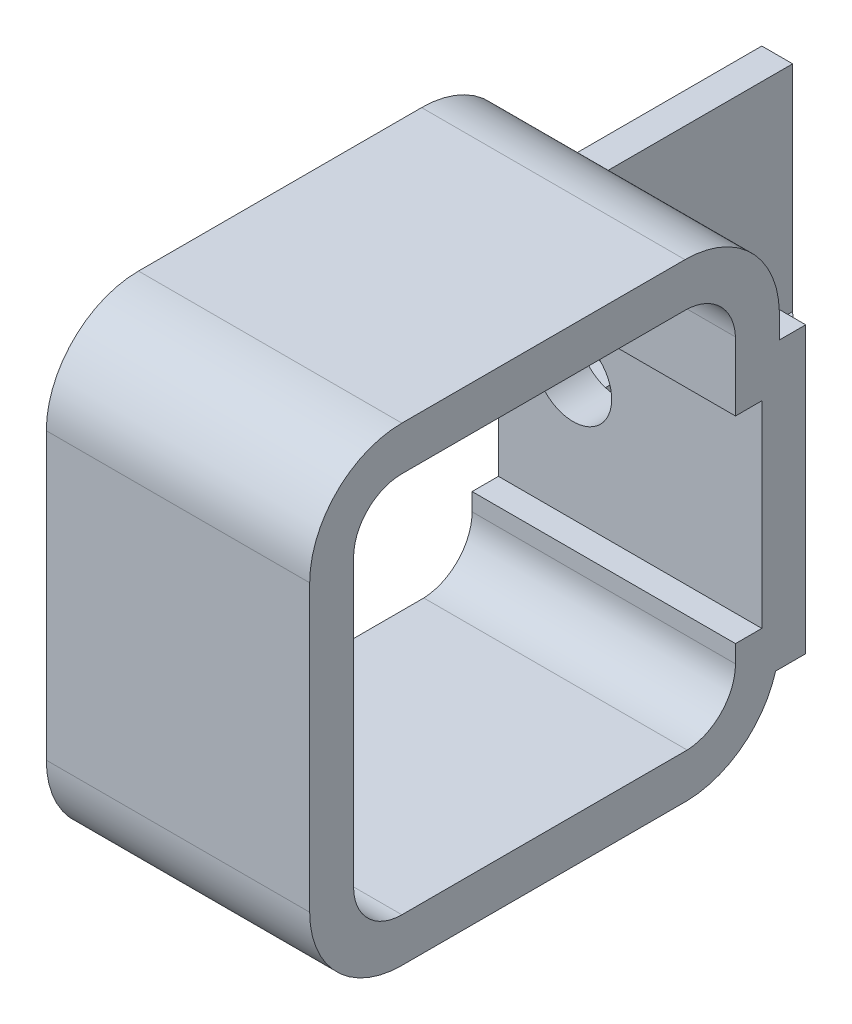
ISO-10303-21;
HEADER;
FILE_DESCRIPTION(('STEP AP214'),'2;1');
FILE_NAME('part.step','',(''),(''),'','','');
FILE_SCHEMA(('AUTOMOTIVE_DESIGN { 1 0 10303 214 1 1 1 1 }'));
ENDSEC;
DATA;
#1=APPLICATION_CONTEXT('core data for automotive mechanical design processes');
#2=APPLICATION_PROTOCOL_DEFINITION('international standard','automotive_design',2000,#1);
#3=PRODUCT_CONTEXT('',#1,'mechanical');
#4=PRODUCT('Part','Part','',(#3));
#5=PRODUCT_RELATED_PRODUCT_CATEGORY('part','',(#4));
#6=PRODUCT_DEFINITION_FORMATION('','',#4);
#7=PRODUCT_DEFINITION_CONTEXT('part definition',#1,'design');
#8=PRODUCT_DEFINITION('design','',#6,#7);
#9=PRODUCT_DEFINITION_SHAPE('','',#8);
#10=(LENGTH_UNIT() NAMED_UNIT(*) SI_UNIT(.MILLI.,.METRE.));
#11=(NAMED_UNIT(*) PLANE_ANGLE_UNIT() SI_UNIT($,.RADIAN.));
#12=(NAMED_UNIT(*) SI_UNIT($,.STERADIAN.) SOLID_ANGLE_UNIT());
#13=UNCERTAINTY_MEASURE_WITH_UNIT(LENGTH_MEASURE(1.E-05),#10,'distance_accuracy_value','');
#14=(GEOMETRIC_REPRESENTATION_CONTEXT(3) GLOBAL_UNCERTAINTY_ASSIGNED_CONTEXT((#13)) GLOBAL_UNIT_ASSIGNED_CONTEXT((#10,
#11,#12)) REPRESENTATION_CONTEXT('',''));
#15=CARTESIAN_POINT('',(0.,0.,0.));
#16=DIRECTION('',(0.,0.,1.));
#17=DIRECTION('',(1.,0.,0.));
#18=AXIS2_PLACEMENT_3D('',#15,#16,#17);
#19=CARTESIAN_POINT('',(0.,0.,0.));
#20=DIRECTION('',(1.,0.,0.));
#21=DIRECTION('',(0.,0.,-1.));
#22=AXIS2_PLACEMENT_3D('',#19,#20,#21);
#23=PLANE('',#22);
#24=DIRECTION('',(0.,-1.,0.));
#25=VECTOR('',#24,1.);
#26=CARTESIAN_POINT('',(0.,0.,13.0376172660877));
#27=LINE('',#26,#25);
#28=CARTESIAN_POINT('',(0.,-3.53074133145201,13.0376172660876));
#29=VERTEX_POINT('',#28);
#30=CARTESIAN_POINT('',(0.,-36.0307413314518,13.0376172660875));
#31=VERTEX_POINT('',#30);
#32=EDGE_CURVE('E413',#29,#31,#27,.T.);
#33=ORIENTED_EDGE('',*,*,#32,.T.);
#34=CARTESIAN_POINT('',(0.,-36.0307413314518,7.53761726608743));
#35=DIRECTION('',(1.,0.,0.));
#36=DIRECTION('',(0.,0.,-1.));
#37=AXIS2_PLACEMENT_3D('',#34,#35,#36);
#38=CIRCLE('',#37,5.5000000000001);
#39=CARTESIAN_POINT('',(0.,-41.5307413314519,7.53761726608741));
#40=VERTEX_POINT('',#39);
#41=EDGE_CURVE('E323',#40,#31,#38,.F.);
#42=ORIENTED_EDGE('',*,*,#41,.F.);
#43=DIRECTION('',(0.,0.,-1.));
#44=VECTOR('',#43,1.);
#45=CARTESIAN_POINT('',(0.,-41.5307413314519,0.));
#46=LINE('',#45,#44);
#47=CARTESIAN_POINT('',(0.,-41.5307413314519,-24.9623827339103));
#48=VERTEX_POINT('',#47);
#49=EDGE_CURVE('E443',#40,#48,#46,.T.);
#50=ORIENTED_EDGE('',*,*,#49,.T.);
#51=CARTESIAN_POINT('',(0.,-35.7807413314519,-24.7067009157306));
#52=DIRECTION('',(1.,0.,0.));
#53=DIRECTION('',(0.,0.,-1.));
#54=AXIS2_PLACEMENT_3D('',#51,#52,#53);
#55=CIRCLE('',#54,5.75568181818172);
#56=CARTESIAN_POINT('',(0.,-35.7807413314518,-30.4623827339124));
#57=VERTEX_POINT('',#56);
#58=EDGE_CURVE('E440',#57,#48,#55,.F.);
#59=ORIENTED_EDGE('',*,*,#58,.F.);
#60=DIRECTION('',(0.,-1.,0.));
#61=VECTOR('',#60,1.);
#62=CARTESIAN_POINT('',(0.,5.28438104627105E-13,-30.4623827339117));
#63=LINE('',#62,#61);
#64=CARTESIAN_POINT('',(0.,-33.7807413314519,-30.4623827339123));
#65=VERTEX_POINT('',#64);
#66=EDGE_CURVE('E437',#65,#57,#63,.T.);
#67=ORIENTED_EDGE('',*,*,#66,.F.);
#68=DIRECTION('',(0.,0.,1.));
#69=VECTOR('',#68,1.);
#70=CARTESIAN_POINT('',(0.,-33.7807413314519,0.));
#71=LINE('',#70,#69);
#72=CARTESIAN_POINT('',(0.,-33.7807413314519,-33.4623827339123));
#73=VERTEX_POINT('',#72);
#74=EDGE_CURVE('E434',#73,#65,#71,.T.);
#75=ORIENTED_EDGE('',*,*,#74,.F.);
#76=DIRECTION('',(0.,-1.,0.));
#77=VECTOR('',#76,1.);
#78=CARTESIAN_POINT('',(0.,0.,-33.4623827339123));
#79=LINE('',#78,#77);
#80=CARTESIAN_POINT('',(0.,-11.3307413314518,-33.4623827339123));
#81=VERTEX_POINT('',#80);
#82=EDGE_CURVE('E431',#81,#73,#79,.T.);
#83=ORIENTED_EDGE('',*,*,#82,.F.);
#84=DIRECTION('',(0.,0.,-1.));
#85=VECTOR('',#84,1.);
#86=CARTESIAN_POINT('',(0.,-11.3307413314518,0.));
#87=LINE('',#86,#85);
#88=CARTESIAN_POINT('',(0.,-11.3307413314518,-30.4623827339123));
#89=VERTEX_POINT('',#88);
#90=EDGE_CURVE('E428',#89,#81,#87,.T.);
#91=ORIENTED_EDGE('',*,*,#90,.F.);
#92=DIRECTION('',(0.,-1.,0.));
#93=VECTOR('',#92,1.);
#94=CARTESIAN_POINT('',(0.,3.11642984780029E-13,-30.4623827339122));
#95=LINE('',#94,#93);
#96=CARTESIAN_POINT('',(0.,-3.53074133145067,-30.4623827339122));
#97=VERTEX_POINT('',#96);
#98=EDGE_CURVE('E425',#97,#89,#95,.T.);
#99=ORIENTED_EDGE('',*,*,#98,.F.);
#100=CARTESIAN_POINT('',(0.,-3.78642314963352,-24.7123827339124));
#101=DIRECTION('',(1.,0.,0.));
#102=DIRECTION('',(0.,0.,-1.));
#103=AXIS2_PLACEMENT_3D('',#100,#101,#102);
#104=CIRCLE('',#103,5.75568181818172);
#105=CARTESIAN_POINT('',(0.,1.96925866854822,-24.7123827339124));
#106=VERTEX_POINT('',#105);
#107=EDGE_CURVE('E422',#106,#97,#104,.F.);
#108=ORIENTED_EDGE('',*,*,#107,.F.);
#109=DIRECTION('',(0.,0.,-1.));
#110=VECTOR('',#109,1.);
#111=CARTESIAN_POINT('',(0.,1.96925866854803,0.));
#112=LINE('',#111,#110);
#113=CARTESIAN_POINT('',(0.,1.96925866854797,7.53761726608761));
#114=VERTEX_POINT('',#113);
#115=EDGE_CURVE('E419',#114,#106,#112,.T.);
#116=ORIENTED_EDGE('',*,*,#115,.F.);
#117=CARTESIAN_POINT('',(0.,-3.53074133145199,7.53761726608768));
#118=DIRECTION('',(1.,0.,0.));
#119=DIRECTION('',(0.,0.,-1.));
#120=AXIS2_PLACEMENT_3D('',#117,#118,#119);
#121=CIRCLE('',#120,5.49999999999996);
#122=EDGE_CURVE('E416',#29,#114,#121,.F.);
#123=ORIENTED_EDGE('',*,*,#122,.F.);
#124=EDGE_LOOP('',(#33,#42,#50,#59,#67,#75,#83,#91,#99,#108,#116,#123));
#125=FACE_BOUND('',#124,.T.);
#126=CARTESIAN_POINT('',(0.,-3.78371752192795,-24.7123827339124));
#127=DIRECTION('',(1.,0.,0.));
#128=DIRECTION('',(0.,0.,-1.));
#129=AXIS2_PLACEMENT_3D('',#126,#127,#128);
#130=CIRCLE('',#129,10.752976190476);
#131=CARTESIAN_POINT('',(0.,6.96925866854797,-24.7123827339124));
#132=VERTEX_POINT('',#131);
#133=CARTESIAN_POINT('',(0.,-3.53074133145067,-35.4623827339122));
#134=VERTEX_POINT('',#133);
#135=EDGE_CURVE('E318',#132,#134,#130,.F.);
#136=ORIENTED_EDGE('',*,*,#135,.T.);
#137=DIRECTION('',(0.,-1.,-1.06561584952806E-13));
#138=VECTOR('',#137,1.);
#139=CARTESIAN_POINT('',(0.,3.77892771032867E-12,-35.4623827339119));
#140=LINE('',#139,#138);
#141=CARTESIAN_POINT('',(0.,-6.33074133145212,-35.4623827339125));
#142=VERTEX_POINT('',#141);
#143=EDGE_CURVE('E410',#134,#142,#140,.T.);
#144=ORIENTED_EDGE('',*,*,#143,.T.);
#145=DIRECTION('',(0.,0.,-1.));
#146=VECTOR('',#145,1.);
#147=CARTESIAN_POINT('',(0.,-6.33074133145212,0.));
#148=LINE('',#147,#146);
#149=CARTESIAN_POINT('',(0.,-6.33074133145209,-63.4623827339123));
#150=VERTEX_POINT('',#149);
#151=EDGE_CURVE('E408',#142,#150,#148,.T.);
#152=ORIENTED_EDGE('',*,*,#151,.T.);
#153=DIRECTION('',(0.,-1.,0.));
#154=VECTOR('',#153,1.);
#155=CARTESIAN_POINT('',(0.,-6.33074133145209,-63.4623827339123));
#156=LINE('',#155,#154);
#157=CARTESIAN_POINT('',(0.,-38.7807413314519,-63.4623827339123));
#158=VERTEX_POINT('',#157);
#159=EDGE_CURVE('E305',#150,#158,#156,.T.);
#160=ORIENTED_EDGE('',*,*,#159,.T.);
#161=DIRECTION('',(0.,0.,1.));
#162=VECTOR('',#161,1.);
#163=CARTESIAN_POINT('',(0.,-38.7807413314519,0.));
#164=LINE('',#163,#162);
#165=CARTESIAN_POINT('',(0.,-38.7807413314519,-35.035529086146));
#166=VERTEX_POINT('',#165);
#167=EDGE_CURVE('E405',#158,#166,#164,.T.);
#168=ORIENTED_EDGE('',*,*,#167,.T.);
#169=CARTESIAN_POINT('',(0.,-35.7807413314518,-24.7067009157306));
#170=DIRECTION('',(1.,0.,0.));
#171=DIRECTION('',(0.,0.,-1.));
#172=AXIS2_PLACEMENT_3D('',#169,#170,#171);
#173=CIRCLE('',#172,10.7556818181819);
#174=CARTESIAN_POINT('',(0.,-46.5307413314519,-25.0562597433475));
#175=VERTEX_POINT('',#174);
#176=EDGE_CURVE('E402',#166,#175,#173,.F.);
#177=ORIENTED_EDGE('',*,*,#176,.T.);
#178=DIRECTION('',(0.,0.,-1.));
#179=VECTOR('',#178,1.);
#180=CARTESIAN_POINT('',(0.,-46.5307413314519,0.));
#181=LINE('',#180,#179);
#182=CARTESIAN_POINT('',(0.,-46.5307413314519,7.53761726608754));
#183=VERTEX_POINT('',#182);
#184=EDGE_CURVE('E399',#183,#175,#181,.T.);
#185=ORIENTED_EDGE('',*,*,#184,.F.);
#186=CARTESIAN_POINT('',(0.,-36.0307413314518,7.53761726608754));
#187=DIRECTION('',(1.,0.,0.));
#188=DIRECTION('',(0.,0.,-1.));
#189=AXIS2_PLACEMENT_3D('',#186,#187,#188);
#190=CIRCLE('',#189,10.5000000000001);
#191=CARTESIAN_POINT('',(0.,-36.0307413314518,18.0376172660876));
#192=VERTEX_POINT('',#191);
#193=EDGE_CURVE('E396',#183,#192,#190,.F.);
#194=ORIENTED_EDGE('',*,*,#193,.T.);
#195=DIRECTION('',(0.,-1.,0.));
#196=VECTOR('',#195,1.);
#197=CARTESIAN_POINT('',(0.,0.,18.0376172660876));
#198=LINE('',#197,#196);
#199=CARTESIAN_POINT('',(0.,-3.53074133145199,18.0376172660876));
#200=VERTEX_POINT('',#199);
#201=EDGE_CURVE('E393',#200,#192,#198,.T.);
#202=ORIENTED_EDGE('',*,*,#201,.F.);
#203=CARTESIAN_POINT('',(0.,-3.53074133145223,7.53761726608768));
#204=DIRECTION('',(1.,0.,0.));
#205=DIRECTION('',(0.,0.,-1.));
#206=AXIS2_PLACEMENT_3D('',#203,#204,#205);
#207=CIRCLE('',#206,10.5000000000001);
#208=CARTESIAN_POINT('',(0.,6.96925866854797,7.53761726608768));
#209=VERTEX_POINT('',#208);
#210=EDGE_CURVE('E390',#200,#209,#207,.F.);
#211=ORIENTED_EDGE('',*,*,#210,.T.);
#212=DIRECTION('',(0.,0.,-1.));
#213=VECTOR('',#212,1.);
#214=CARTESIAN_POINT('',(0.,6.96925866854797,0.));
#215=LINE('',#214,#213);
#216=EDGE_CURVE('E387',#209,#132,#215,.T.);
#217=ORIENTED_EDGE('',*,*,#216,.T.);
#218=EDGE_LOOP('',(#136,#144,#152,#160,#168,#177,#185,#194,#202,#211,#217));
#219=FACE_BOUND('',#218,.T.);
#220=CARTESIAN_POINT('',(0.,-22.6397290251602,-53.4623827339123));
#221=DIRECTION('',(1.,0.,0.));
#222=DIRECTION('',(0.,0.,-1.));
#223=AXIS2_PLACEMENT_3D('',#220,#221,#222);
#224=CIRCLE('',#223,3.);
#225=CARTESIAN_POINT('',(0.,-22.6397290251602,-56.4623827339123));
#226=VERTEX_POINT('',#225);
#227=EDGE_CURVE('E292',#226,#226,#224,.T.);
#228=ORIENTED_EDGE('',*,*,#227,.T.);
#229=EDGE_LOOP('',(#228));
#230=FACE_BOUND('',#229,.T.);
#231=DIRECTION('',(0.,1.,0.));
#232=VECTOR('',#231,1.);
#233=CARTESIAN_POINT('',(0.,0.,-44.4623827339123));
#234=LINE('',#233,#232);
#235=CARTESIAN_POINT('',(0.,-27.613548677598,-44.4623827339123));
#236=VERTEX_POINT('',#235);
#237=CARTESIAN_POINT('',(0.,-12.613548677598,-44.4623827339123));
#238=VERTEX_POINT('',#237);
#239=EDGE_CURVE('E249',#236,#238,#234,.T.);
#240=ORIENTED_EDGE('',*,*,#239,.T.);
#241=DIRECTION('',(0.,0.,1.));
#242=VECTOR('',#241,1.);
#243=CARTESIAN_POINT('',(0.,-12.613548677598,0.));
#244=LINE('',#243,#242);
#245=CARTESIAN_POINT('',(0.,-12.613548677598,-38.4623827339123));
#246=VERTEX_POINT('',#245);
#247=EDGE_CURVE('E271',#238,#246,#244,.T.);
#248=ORIENTED_EDGE('',*,*,#247,.T.);
#249=DIRECTION('',(0.,1.,0.));
#250=VECTOR('',#249,1.);
#251=CARTESIAN_POINT('',(0.,0.,-38.4623827339123));
#252=LINE('',#251,#250);
#253=CARTESIAN_POINT('',(0.,-27.613548677598,-38.4623827339123));
#254=VERTEX_POINT('',#253);
#255=EDGE_CURVE('E558',#254,#246,#252,.T.);
#256=ORIENTED_EDGE('',*,*,#255,.F.);
#257=DIRECTION('',(0.,0.,-1.));
#258=VECTOR('',#257,1.);
#259=CARTESIAN_POINT('',(0.,-27.613548677598,0.));
#260=LINE('',#259,#258);
#261=EDGE_CURVE('E275',#254,#236,#260,.T.);
#262=ORIENTED_EDGE('',*,*,#261,.T.);
#263=EDGE_LOOP('',(#240,#248,#256,#262));
#264=FACE_BOUND('',#263,.T.);
#265=ADVANCED_FACE('F47',(#125,#219,#230,#264),#23,.F.);
#266=CARTESIAN_POINT('',(3.51144321135217,-6.33074133145209,-63.4623827339123));
#267=DIRECTION('',(-1.,0.,0.));
#268=DIRECTION('',(0.,0.,1.));
#269=AXIS2_PLACEMENT_3D('',#266,#267,#268);
#270=PLANE('',#269);
#271=CARTESIAN_POINT('',(3.51144321135217,-22.6397290251602,-53.4623827339123));
#272=DIRECTION('',(1.,0.,0.));
#273=DIRECTION('',(0.,0.,-1.));
#274=AXIS2_PLACEMENT_3D('',#271,#272,#273);
#275=CIRCLE('',#274,3.);
#276=CARTESIAN_POINT('',(3.51144321135217,-22.6397290251602,-56.4623827339123));
#277=VERTEX_POINT('',#276);
#278=EDGE_CURVE('E289',#277,#277,#275,.T.);
#279=ORIENTED_EDGE('',*,*,#278,.F.);
#280=EDGE_LOOP('',(#279));
#281=FACE_BOUND('',#280,.T.);
#282=DIRECTION('',(0.,0.,-1.));
#283=VECTOR('',#282,1.);
#284=CARTESIAN_POINT('',(3.51144321135217,-12.613548677598,0.));
#285=LINE('',#284,#283);
#286=CARTESIAN_POINT('',(3.51144321135217,-12.613548677598,-38.4623827339123));
#287=VERTEX_POINT('',#286);
#288=CARTESIAN_POINT('',(3.51144321135217,-12.613548677598,-44.4623827339123));
#289=VERTEX_POINT('',#288);
#290=EDGE_CURVE('E252',#287,#289,#285,.T.);
#291=ORIENTED_EDGE('',*,*,#290,.T.);
#292=DIRECTION('',(0.,-1.,0.));
#293=VECTOR('',#292,1.);
#294=CARTESIAN_POINT('',(3.51144321135217,0.,-44.4623827339123));
#295=LINE('',#294,#293);
#296=CARTESIAN_POINT('',(3.51144321135217,-27.613548677598,-44.4623827339123));
#297=VERTEX_POINT('',#296);
#298=EDGE_CURVE('E246',#289,#297,#295,.T.);
#299=ORIENTED_EDGE('',*,*,#298,.T.);
#300=DIRECTION('',(0.,0.,1.));
#301=VECTOR('',#300,1.);
#302=CARTESIAN_POINT('',(3.51144321135217,-27.613548677598,0.));
#303=LINE('',#302,#301);
#304=CARTESIAN_POINT('',(3.51144321135217,-27.613548677598,-38.4623827339123));
#305=VERTEX_POINT('',#304);
#306=EDGE_CURVE('E254',#297,#305,#303,.T.);
#307=ORIENTED_EDGE('',*,*,#306,.T.);
#308=DIRECTION('',(0.,-1.,0.));
#309=VECTOR('',#308,1.);
#310=CARTESIAN_POINT('',(3.51144321135217,-6.33074133145212,-38.4623827339123));
#311=LINE('',#310,#309);
#312=CARTESIAN_POINT('',(3.51144321135217,-30.7807413314519,-38.4623827339123));
#313=VERTEX_POINT('',#312);
#314=EDGE_CURVE('E295',#305,#313,#311,.T.);
#315=ORIENTED_EDGE('',*,*,#314,.T.);
#316=DIRECTION('',(0.,0.,1.));
#317=VECTOR('',#316,1.);
#318=CARTESIAN_POINT('',(3.51144321135217,-30.7807413314519,-91.1326490995515));
#319=LINE('',#318,#317);
#320=CARTESIAN_POINT('',(3.51144321135217,-30.7807413314519,-63.4623827339123));
#321=VERTEX_POINT('',#320);
#322=EDGE_CURVE('E286',#321,#313,#319,.T.);
#323=ORIENTED_EDGE('',*,*,#322,.F.);
#324=DIRECTION('',(0.,-1.,0.));
#325=VECTOR('',#324,1.);
#326=CARTESIAN_POINT('',(3.51144321135217,-6.33074133145209,-63.4623827339123));
#327=LINE('',#326,#325);
#328=CARTESIAN_POINT('',(3.51144321135217,-6.33074133145209,-63.4623827339123));
#329=VERTEX_POINT('',#328);
#330=EDGE_CURVE('E299',#329,#321,#327,.T.);
#331=ORIENTED_EDGE('',*,*,#330,.F.);
#332=DIRECTION('',(0.,0.,1.));
#333=VECTOR('',#332,1.);
#334=CARTESIAN_POINT('',(3.51144321135217,-6.33074133145209,-63.4623827339123));
#335=LINE('',#334,#333);
#336=CARTESIAN_POINT('',(3.51144321135217,-6.33074133145212,-38.4623827339123));
#337=VERTEX_POINT('',#336);
#338=EDGE_CURVE('E308',#329,#337,#335,.T.);
#339=ORIENTED_EDGE('',*,*,#338,.T.);
#340=EDGE_CURVE('E300',#337,#287,#311,.T.);
#341=ORIENTED_EDGE('',*,*,#340,.T.);
#342=EDGE_LOOP('',(#291,#299,#307,#315,#323,#331,#339,#341));
#343=FACE_BOUND('',#342,.T.);
#344=ADVANCED_FACE('F259',(#281,#343),#270,.F.);
#345=CARTESIAN_POINT('',(30.,0.,13.0376172660877));
#346=DIRECTION('',(0.,0.,-1.));
#347=DIRECTION('',(0.,1.,0.));
#348=AXIS2_PLACEMENT_3D('',#345,#346,#347);
#349=PLANE('',#348);
#350=ORIENTED_EDGE('',*,*,#32,.F.);
#351=DIRECTION('',(-1.,0.,0.));
#352=VECTOR('',#351,1.);
#353=CARTESIAN_POINT('',(30.,-3.53074133145201,13.0376172660876));
#354=LINE('',#353,#352);
#355=CARTESIAN_POINT('',(30.,-3.53074133145201,13.0376172660876));
#356=VERTEX_POINT('',#355);
#357=EDGE_CURVE('E11',#356,#29,#354,.T.);
#358=ORIENTED_EDGE('',*,*,#357,.F.);
#359=DIRECTION('',(0.,-1.,0.));
#360=VECTOR('',#359,1.);
#361=CARTESIAN_POINT('',(30.,0.,13.0376172660877));
#362=LINE('',#361,#360);
#363=CARTESIAN_POINT('',(30.,-36.0307413314518,13.0376172660875));
#364=VERTEX_POINT('',#363);
#365=EDGE_CURVE('E350',#356,#364,#362,.T.);
#366=ORIENTED_EDGE('',*,*,#365,.T.);
#367=DIRECTION('',(-1.,0.,0.));
#368=VECTOR('',#367,1.);
#369=CARTESIAN_POINT('',(30.,-36.0307413314518,13.0376172660875));
#370=LINE('',#369,#368);
#371=EDGE_CURVE('E448',#364,#31,#370,.T.);
#372=ORIENTED_EDGE('',*,*,#371,.T.);
#373=EDGE_LOOP('',(#350,#358,#366,#372));
#374=FACE_BOUND('',#373,.T.);
#375=ADVANCED_FACE('F582',(#374),#349,.T.);
#376=CARTESIAN_POINT('',(30.,-3.53074133145199,7.53761726608768));
#377=DIRECTION('',(-1.,0.,0.));
#378=DIRECTION('',(0.,0.,1.));
#379=AXIS2_PLACEMENT_3D('',#376,#377,#378);
#380=CYLINDRICAL_SURFACE('',#379,5.49999999999996);
#381=ORIENTED_EDGE('',*,*,#122,.T.);
#382=DIRECTION('',(-1.,0.,0.));
#383=VECTOR('',#382,1.);
#384=CARTESIAN_POINT('',(30.,1.96925866854797,7.53761726608761));
#385=LINE('',#384,#383);
#386=CARTESIAN_POINT('',(30.,1.96925866854797,7.53761726608761));
#387=VERTEX_POINT('',#386);
#388=EDGE_CURVE('E56',#387,#114,#385,.T.);
#389=ORIENTED_EDGE('',*,*,#388,.F.);
#390=CARTESIAN_POINT('',(30.,-3.53074133145199,7.53761726608768));
#391=DIRECTION('',(1.,0.,0.));
#392=DIRECTION('',(0.,0.,-1.));
#393=AXIS2_PLACEMENT_3D('',#390,#391,#392);
#394=CIRCLE('',#393,5.49999999999996);
#395=EDGE_CURVE('E353',#356,#387,#394,.F.);
#396=ORIENTED_EDGE('',*,*,#395,.F.);
#397=ORIENTED_EDGE('',*,*,#357,.T.);
#398=EDGE_LOOP('',(#381,#389,#396,#397));
#399=FACE_BOUND('',#398,.T.);
#400=ADVANCED_FACE('F627',(#399),#380,.F.);
#401=CARTESIAN_POINT('',(30.,1.96925866854803,0.));
#402=DIRECTION('',(0.,1.,0.));
#403=DIRECTION('',(0.,0.,1.));
#404=AXIS2_PLACEMENT_3D('',#401,#402,#403);
#405=PLANE('',#404);
#406=ORIENTED_EDGE('',*,*,#115,.T.);
#407=DIRECTION('',(-1.,0.,0.));
#408=VECTOR('',#407,1.);
#409=CARTESIAN_POINT('',(30.,1.96925866854822,-24.7123827339124));
#410=LINE('',#409,#408);
#411=CARTESIAN_POINT('',(30.,1.96925866854822,-24.7123827339124));
#412=VERTEX_POINT('',#411);
#413=EDGE_CURVE('E472',#412,#106,#410,.T.);
#414=ORIENTED_EDGE('',*,*,#413,.F.);
#415=DIRECTION('',(0.,0.,-1.));
#416=VECTOR('',#415,1.);
#417=CARTESIAN_POINT('',(30.,1.96925866854803,0.));
#418=LINE('',#417,#416);
#419=EDGE_CURVE('E356',#387,#412,#418,.T.);
#420=ORIENTED_EDGE('',*,*,#419,.F.);
#421=ORIENTED_EDGE('',*,*,#388,.T.);
#422=EDGE_LOOP('',(#406,#414,#420,#421));
#423=FACE_BOUND('',#422,.T.);
#424=ADVANCED_FACE('F623',(#423),#405,.F.);
#425=CARTESIAN_POINT('',(30.,-3.78642314963352,-24.7123827339124));
#426=DIRECTION('',(-1.,0.,0.));
#427=DIRECTION('',(0.,0.,1.));
#428=AXIS2_PLACEMENT_3D('',#425,#426,#427);
#429=CYLINDRICAL_SURFACE('',#428,5.75568181818172);
#430=ORIENTED_EDGE('',*,*,#107,.T.);
#431=DIRECTION('',(-1.,0.,0.));
#432=VECTOR('',#431,1.);
#433=CARTESIAN_POINT('',(30.,-3.53074133145067,-30.4623827339122));
#434=LINE('',#433,#432);
#435=CARTESIAN_POINT('',(30.,-3.53074133145067,-30.4623827339122));
#436=VERTEX_POINT('',#435);
#437=EDGE_CURVE('E469',#436,#97,#434,.T.);
#438=ORIENTED_EDGE('',*,*,#437,.F.);
#439=CARTESIAN_POINT('',(30.,-3.78642314963352,-24.7123827339124));
#440=DIRECTION('',(1.,0.,0.));
#441=DIRECTION('',(0.,0.,-1.));
#442=AXIS2_PLACEMENT_3D('',#439,#440,#441);
#443=CIRCLE('',#442,5.75568181818172);
#444=EDGE_CURVE('E359',#412,#436,#443,.F.);
#445=ORIENTED_EDGE('',*,*,#444,.F.);
#446=ORIENTED_EDGE('',*,*,#413,.T.);
#447=EDGE_LOOP('',(#430,#438,#445,#446));
#448=FACE_BOUND('',#447,.T.);
#449=ADVANCED_FACE('F619',(#448),#429,.F.);
#450=CARTESIAN_POINT('',(30.,3.11642984780029E-13,-30.4623827339122));
#451=DIRECTION('',(0.,0.,-1.));
#452=DIRECTION('',(0.,1.,0.));
#453=AXIS2_PLACEMENT_3D('',#450,#451,#452);
#454=PLANE('',#453);
#455=ORIENTED_EDGE('',*,*,#98,.T.);
#456=DIRECTION('',(-1.,0.,0.));
#457=VECTOR('',#456,1.);
#458=CARTESIAN_POINT('',(30.,-11.3307413314518,-30.4623827339123));
#459=LINE('',#458,#457);
#460=CARTESIAN_POINT('',(30.,-11.3307413314518,-30.4623827339123));
#461=VERTEX_POINT('',#460);
#462=EDGE_CURVE('E466',#461,#89,#459,.T.);
#463=ORIENTED_EDGE('',*,*,#462,.F.);
#464=DIRECTION('',(0.,-1.,0.));
#465=VECTOR('',#464,1.);
#466=CARTESIAN_POINT('',(30.,3.11642984780029E-13,-30.4623827339122));
#467=LINE('',#466,#465);
#468=EDGE_CURVE('E362',#436,#461,#467,.T.);
#469=ORIENTED_EDGE('',*,*,#468,.F.);
#470=ORIENTED_EDGE('',*,*,#437,.T.);
#471=EDGE_LOOP('',(#455,#463,#469,#470));
#472=FACE_BOUND('',#471,.T.);
#473=ADVANCED_FACE('F615',(#472),#454,.F.);
#474=CARTESIAN_POINT('',(30.,-11.3307413314518,0.));
#475=DIRECTION('',(0.,1.,0.));
#476=DIRECTION('',(0.,0.,1.));
#477=AXIS2_PLACEMENT_3D('',#474,#475,#476);
#478=PLANE('',#477);
#479=ORIENTED_EDGE('',*,*,#90,.T.);
#480=DIRECTION('',(-1.,0.,0.));
#481=VECTOR('',#480,1.);
#482=CARTESIAN_POINT('',(30.,-11.3307413314518,-33.4623827339123));
#483=LINE('',#482,#481);
#484=CARTESIAN_POINT('',(30.,-11.3307413314518,-33.4623827339123));
#485=VERTEX_POINT('',#484);
#486=EDGE_CURVE('E463',#485,#81,#483,.T.);
#487=ORIENTED_EDGE('',*,*,#486,.F.);
#488=DIRECTION('',(0.,0.,-1.));
#489=VECTOR('',#488,1.);
#490=CARTESIAN_POINT('',(30.,-11.3307413314518,0.));
#491=LINE('',#490,#489);
#492=EDGE_CURVE('E365',#461,#485,#491,.T.);
#493=ORIENTED_EDGE('',*,*,#492,.F.);
#494=ORIENTED_EDGE('',*,*,#462,.T.);
#495=EDGE_LOOP('',(#479,#487,#493,#494));
#496=FACE_BOUND('',#495,.T.);
#497=ADVANCED_FACE('F611',(#496),#478,.F.);
#498=CARTESIAN_POINT('',(30.,0.,-33.4623827339123));
#499=DIRECTION('',(0.,0.,-1.));
#500=DIRECTION('',(0.,1.,0.));
#501=AXIS2_PLACEMENT_3D('',#498,#499,#500);
#502=PLANE('',#501);
#503=CARTESIAN_POINT('',(8.5,-19.7307413314521,-33.4623827339123));
#504=DIRECTION('',(0.,0.,-1.));
#505=DIRECTION('',(0.,1.,0.));
#506=AXIS2_PLACEMENT_3D('',#503,#504,#505);
#507=CIRCLE('',#506,4.4);
#508=CARTESIAN_POINT('',(8.5,-15.3307413314521,-33.4623827339123));
#509=VERTEX_POINT('',#508);
#510=EDGE_CURVE('E315',#509,#509,#507,.T.);
#511=ORIENTED_EDGE('',*,*,#510,.T.);
#512=EDGE_LOOP('',(#511));
#513=FACE_BOUND('',#512,.T.);
#514=ORIENTED_EDGE('',*,*,#82,.T.);
#515=DIRECTION('',(-1.,0.,0.));
#516=VECTOR('',#515,1.);
#517=CARTESIAN_POINT('',(30.,-33.7807413314519,-33.4623827339123));
#518=LINE('',#517,#516);
#519=CARTESIAN_POINT('',(30.,-33.7807413314519,-33.4623827339123));
#520=VERTEX_POINT('',#519);
#521=EDGE_CURVE('E460',#520,#73,#518,.T.);
#522=ORIENTED_EDGE('',*,*,#521,.F.);
#523=DIRECTION('',(0.,-1.,0.));
#524=VECTOR('',#523,1.);
#525=CARTESIAN_POINT('',(30.,0.,-33.4623827339123));
#526=LINE('',#525,#524);
#527=EDGE_CURVE('E368',#485,#520,#526,.T.);
#528=ORIENTED_EDGE('',*,*,#527,.F.);
#529=ORIENTED_EDGE('',*,*,#486,.T.);
#530=EDGE_LOOP('',(#514,#522,#528,#529));
#531=FACE_BOUND('',#530,.T.);
#532=ADVANCED_FACE('F607',(#513,#531),#502,.F.);
#533=CARTESIAN_POINT('',(30.,-33.7807413314519,0.));
#534=DIRECTION('',(0.,-1.,0.));
#535=DIRECTION('',(0.,0.,-1.));
#536=AXIS2_PLACEMENT_3D('',#533,#534,#535);
#537=PLANE('',#536);
#538=ORIENTED_EDGE('',*,*,#74,.T.);
#539=DIRECTION('',(-1.,0.,0.));
#540=VECTOR('',#539,1.);
#541=CARTESIAN_POINT('',(30.,-33.7807413314519,-30.4623827339123));
#542=LINE('',#541,#540);
#543=CARTESIAN_POINT('',(30.,-33.7807413314519,-30.4623827339123));
#544=VERTEX_POINT('',#543);
#545=EDGE_CURVE('E457',#544,#65,#542,.T.);
#546=ORIENTED_EDGE('',*,*,#545,.F.);
#547=DIRECTION('',(0.,0.,1.));
#548=VECTOR('',#547,1.);
#549=CARTESIAN_POINT('',(30.,-33.7807413314519,0.));
#550=LINE('',#549,#548);
#551=EDGE_CURVE('E371',#520,#544,#550,.T.);
#552=ORIENTED_EDGE('',*,*,#551,.F.);
#553=ORIENTED_EDGE('',*,*,#521,.T.);
#554=EDGE_LOOP('',(#538,#546,#552,#553));
#555=FACE_BOUND('',#554,.T.);
#556=ADVANCED_FACE('F603',(#555),#537,.F.);
#557=CARTESIAN_POINT('',(30.,5.28438104627105E-13,-30.4623827339117));
#558=DIRECTION('',(0.,0.,-1.));
#559=DIRECTION('',(0.,1.,0.));
#560=AXIS2_PLACEMENT_3D('',#557,#558,#559);
#561=PLANE('',#560);
#562=ORIENTED_EDGE('',*,*,#66,.T.);
#563=DIRECTION('',(-1.,0.,0.));
#564=VECTOR('',#563,1.);
#565=CARTESIAN_POINT('',(30.,-35.7807413314518,-30.4623827339124));
#566=LINE('',#565,#564);
#567=CARTESIAN_POINT('',(30.,-35.7807413314518,-30.4623827339124));
#568=VERTEX_POINT('',#567);
#569=EDGE_CURVE('E454',#568,#57,#566,.T.);
#570=ORIENTED_EDGE('',*,*,#569,.F.);
#571=DIRECTION('',(0.,-1.,0.));
#572=VECTOR('',#571,1.);
#573=CARTESIAN_POINT('',(30.,5.28438104627105E-13,-30.4623827339117));
#574=LINE('',#573,#572);
#575=EDGE_CURVE('E374',#544,#568,#574,.T.);
#576=ORIENTED_EDGE('',*,*,#575,.F.);
#577=ORIENTED_EDGE('',*,*,#545,.T.);
#578=EDGE_LOOP('',(#562,#570,#576,#577));
#579=FACE_BOUND('',#578,.T.);
#580=ADVANCED_FACE('F599',(#579),#561,.F.);
#581=CARTESIAN_POINT('',(30.,-35.7807413314519,-24.7067009157306));
#582=DIRECTION('',(-1.,0.,0.));
#583=DIRECTION('',(0.,0.,1.));
#584=AXIS2_PLACEMENT_3D('',#581,#582,#583);
#585=CYLINDRICAL_SURFACE('',#584,5.75568181818172);
#586=ORIENTED_EDGE('',*,*,#58,.T.);
#587=DIRECTION('',(-1.,0.,0.));
#588=VECTOR('',#587,1.);
#589=CARTESIAN_POINT('',(30.,-41.5307413314519,-24.9623827339103));
#590=LINE('',#589,#588);
#591=CARTESIAN_POINT('',(30.,-41.5307413314519,-24.9623827339103));
#592=VERTEX_POINT('',#591);
#593=EDGE_CURVE('E452',#592,#48,#590,.T.);
#594=ORIENTED_EDGE('',*,*,#593,.F.);
#595=CARTESIAN_POINT('',(30.,-35.7807413314519,-24.7067009157306));
#596=DIRECTION('',(1.,0.,0.));
#597=DIRECTION('',(0.,0.,-1.));
#598=AXIS2_PLACEMENT_3D('',#595,#596,#597);
#599=CIRCLE('',#598,5.75568181818172);
#600=EDGE_CURVE('E377',#568,#592,#599,.F.);
#601=ORIENTED_EDGE('',*,*,#600,.F.);
#602=ORIENTED_EDGE('',*,*,#569,.T.);
#603=EDGE_LOOP('',(#586,#594,#601,#602));
#604=FACE_BOUND('',#603,.T.);
#605=ADVANCED_FACE('F595',(#604),#585,.F.);
#606=CARTESIAN_POINT('',(30.,-41.5307413314519,0.));
#607=DIRECTION('',(0.,1.,0.));
#608=DIRECTION('',(0.,0.,1.));
#609=AXIS2_PLACEMENT_3D('',#606,#607,#608);
#610=PLANE('',#609);
#611=ORIENTED_EDGE('',*,*,#49,.F.);
#612=DIRECTION('',(-1.,0.,0.));
#613=VECTOR('',#612,1.);
#614=CARTESIAN_POINT('',(30.,-41.5307413314519,7.53761726608741));
#615=LINE('',#614,#613);
#616=CARTESIAN_POINT('',(30.,-41.5307413314519,7.53761726608741));
#617=VERTEX_POINT('',#616);
#618=EDGE_CURVE('E450',#617,#40,#615,.T.);
#619=ORIENTED_EDGE('',*,*,#618,.F.);
#620=DIRECTION('',(0.,0.,-1.));
#621=VECTOR('',#620,1.);
#622=CARTESIAN_POINT('',(30.,-41.5307413314519,0.));
#623=LINE('',#622,#621);
#624=EDGE_CURVE('E379',#617,#592,#623,.T.);
#625=ORIENTED_EDGE('',*,*,#624,.T.);
#626=ORIENTED_EDGE('',*,*,#593,.T.);
#627=EDGE_LOOP('',(#611,#619,#625,#626));
#628=FACE_BOUND('',#627,.T.);
#629=ADVANCED_FACE('F592',(#628),#610,.T.);
#630=CARTESIAN_POINT('',(30.,-3.78371752192795,-24.7123827339124));
#631=DIRECTION('',(-1.,0.,0.));
#632=DIRECTION('',(0.,0.,1.));
#633=AXIS2_PLACEMENT_3D('',#630,#631,#632);
#634=CYLINDRICAL_SURFACE('',#633,10.752976190476);
#635=ORIENTED_EDGE('',*,*,#135,.F.);
#636=DIRECTION('',(-1.,0.,0.));
#637=VECTOR('',#636,1.);
#638=CARTESIAN_POINT('',(30.,6.96925866854797,-24.7123827339124));
#639=LINE('',#638,#637);
#640=CARTESIAN_POINT('',(30.,6.96925866854797,-24.7123827339124));
#641=VERTEX_POINT('',#640);
#642=EDGE_CURVE('E51',#641,#132,#639,.T.);
#643=ORIENTED_EDGE('',*,*,#642,.F.);
#644=CARTESIAN_POINT('',(30.,-3.78371752192795,-24.7123827339124));
#645=DIRECTION('',(1.,0.,0.));
#646=DIRECTION('',(0.,0.,-1.));
#647=AXIS2_PLACEMENT_3D('',#644,#645,#646);
#648=CIRCLE('',#647,10.752976190476);
#649=CARTESIAN_POINT('',(30.,-3.53074133145067,-35.4623827339122));
#650=VERTEX_POINT('',#649);
#651=EDGE_CURVE('E319',#641,#650,#648,.F.);
#652=ORIENTED_EDGE('',*,*,#651,.T.);
#653=DIRECTION('',(-1.,0.,0.));
#654=VECTOR('',#653,1.);
#655=CARTESIAN_POINT('',(30.,-3.53074133145067,-35.4623827339122));
#656=LINE('',#655,#654);
#657=EDGE_CURVE('E384',#650,#134,#656,.T.);
#658=ORIENTED_EDGE('',*,*,#657,.T.);
#659=EDGE_LOOP('',(#635,#643,#652,#658));
#660=FACE_BOUND('',#659,.T.);
#661=ADVANCED_FACE('F49',(#660),#634,.T.);
#662=CARTESIAN_POINT('',(30.,6.96925866854797,0.));
#663=DIRECTION('',(0.,1.,0.));
#664=DIRECTION('',(0.,0.,1.));
#665=AXIS2_PLACEMENT_3D('',#662,#663,#664);
#666=PLANE('',#665);
#667=ORIENTED_EDGE('',*,*,#216,.F.);
#668=DIRECTION('',(-1.,0.,0.));
#669=VECTOR('',#668,1.);
#670=CARTESIAN_POINT('',(30.,6.96925866854797,7.53761726608768));
#671=LINE('',#670,#669);
#672=CARTESIAN_POINT('',(30.,6.96925866854797,7.53761726608768));
#673=VERTEX_POINT('',#672);
#674=EDGE_CURVE('E492',#673,#209,#671,.T.);
#675=ORIENTED_EDGE('',*,*,#674,.F.);
#676=DIRECTION('',(0.,0.,-1.));
#677=VECTOR('',#676,1.);
#678=CARTESIAN_POINT('',(30.,6.96925866854797,0.));
#679=LINE('',#678,#677);
#680=EDGE_CURVE('E322',#673,#641,#679,.T.);
#681=ORIENTED_EDGE('',*,*,#680,.T.);
#682=ORIENTED_EDGE('',*,*,#642,.T.);
#683=EDGE_LOOP('',(#667,#675,#681,#682));
#684=FACE_BOUND('',#683,.T.);
#685=ADVANCED_FACE('F498',(#684),#666,.T.);
#686=CARTESIAN_POINT('',(30.,-3.53074133145223,7.53761726608768));
#687=DIRECTION('',(-1.,0.,0.));
#688=DIRECTION('',(0.,0.,1.));
#689=AXIS2_PLACEMENT_3D('',#686,#687,#688);
#690=CYLINDRICAL_SURFACE('',#689,10.5000000000001);
#691=ORIENTED_EDGE('',*,*,#210,.F.);
#692=DIRECTION('',(-1.,0.,0.));
#693=VECTOR('',#692,1.);
#694=CARTESIAN_POINT('',(30.,-3.53074133145199,18.0376172660876));
#695=LINE('',#694,#693);
#696=CARTESIAN_POINT('',(30.,-3.53074133145199,18.0376172660876));
#697=VERTEX_POINT('',#696);
#698=EDGE_CURVE('E491',#697,#200,#695,.T.);
#699=ORIENTED_EDGE('',*,*,#698,.F.);
#700=CARTESIAN_POINT('',(30.,-3.53074133145223,7.53761726608768));
#701=DIRECTION('',(1.,0.,0.));
#702=DIRECTION('',(0.,0.,-1.));
#703=AXIS2_PLACEMENT_3D('',#700,#701,#702);
#704=CIRCLE('',#703,10.5000000000001);
#705=EDGE_CURVE('E326',#697,#673,#704,.F.);
#706=ORIENTED_EDGE('',*,*,#705,.T.);
#707=ORIENTED_EDGE('',*,*,#674,.T.);
#708=EDGE_LOOP('',(#691,#699,#706,#707));
#709=FACE_BOUND('',#708,.T.);
#710=ADVANCED_FACE('F506',(#709),#690,.T.);
#711=CARTESIAN_POINT('',(30.,0.,18.0376172660876));
#712=DIRECTION('',(0.,0.,-1.));
#713=DIRECTION('',(0.,1.,0.));
#714=AXIS2_PLACEMENT_3D('',#711,#712,#713);
#715=PLANE('',#714);
#716=ORIENTED_EDGE('',*,*,#201,.T.);
#717=DIRECTION('',(-1.,0.,0.));
#718=VECTOR('',#717,1.);
#719=CARTESIAN_POINT('',(30.,-36.0307413314518,18.0376172660876));
#720=LINE('',#719,#718);
#721=CARTESIAN_POINT('',(30.,-36.0307413314518,18.0376172660876));
#722=VERTEX_POINT('',#721);
#723=EDGE_CURVE('E489',#722,#192,#720,.T.);
#724=ORIENTED_EDGE('',*,*,#723,.F.);
#725=DIRECTION('',(0.,-1.,0.));
#726=VECTOR('',#725,1.);
#727=CARTESIAN_POINT('',(30.,0.,18.0376172660876));
#728=LINE('',#727,#726);
#729=EDGE_CURVE('E329',#697,#722,#728,.T.);
#730=ORIENTED_EDGE('',*,*,#729,.F.);
#731=ORIENTED_EDGE('',*,*,#698,.T.);
#732=EDGE_LOOP('',(#716,#724,#730,#731));
#733=FACE_BOUND('',#732,.T.);
#734=ADVANCED_FACE('F511',(#733),#715,.F.);
#735=CARTESIAN_POINT('',(30.,-36.0307413314518,7.53761726608754));
#736=DIRECTION('',(-1.,0.,0.));
#737=DIRECTION('',(0.,0.,1.));
#738=AXIS2_PLACEMENT_3D('',#735,#736,#737);
#739=CYLINDRICAL_SURFACE('',#738,10.5000000000001);
#740=ORIENTED_EDGE('',*,*,#193,.F.);
#741=DIRECTION('',(-1.,0.,0.));
#742=VECTOR('',#741,1.);
#743=CARTESIAN_POINT('',(30.,-46.5307413314519,7.53761726608754));
#744=LINE('',#743,#742);
#745=CARTESIAN_POINT('',(30.,-46.5307413314519,7.53761726608754));
#746=VERTEX_POINT('',#745);
#747=EDGE_CURVE('E487',#746,#183,#744,.T.);
#748=ORIENTED_EDGE('',*,*,#747,.F.);
#749=CARTESIAN_POINT('',(30.,-36.0307413314518,7.53761726608754));
#750=DIRECTION('',(1.,0.,0.));
#751=DIRECTION('',(0.,0.,-1.));
#752=AXIS2_PLACEMENT_3D('',#749,#750,#751);
#753=CIRCLE('',#752,10.5000000000001);
#754=EDGE_CURVE('E331',#746,#722,#753,.F.);
#755=ORIENTED_EDGE('',*,*,#754,.T.);
#756=ORIENTED_EDGE('',*,*,#723,.T.);
#757=EDGE_LOOP('',(#740,#748,#755,#756));
#758=FACE_BOUND('',#757,.T.);
#759=ADVANCED_FACE('F547',(#758),#739,.T.);
#760=CARTESIAN_POINT('',(30.,-46.5307413314519,0.));
#761=DIRECTION('',(0.,1.,0.));
#762=DIRECTION('',(0.,0.,1.));
#763=AXIS2_PLACEMENT_3D('',#760,#761,#762);
#764=PLANE('',#763);
#765=ORIENTED_EDGE('',*,*,#184,.T.);
#766=DIRECTION('',(-1.,0.,0.));
#767=VECTOR('',#766,1.);
#768=CARTESIAN_POINT('',(30.,-46.5307413314519,-25.0562597433475));
#769=LINE('',#768,#767);
#770=CARTESIAN_POINT('',(30.,-46.5307413314519,-25.0562597433475));
#771=VERTEX_POINT('',#770);
#772=EDGE_CURVE('E485',#771,#175,#769,.T.);
#773=ORIENTED_EDGE('',*,*,#772,.F.);
#774=DIRECTION('',(0.,0.,-1.));
#775=VECTOR('',#774,1.);
#776=CARTESIAN_POINT('',(30.,-46.5307413314519,0.));
#777=LINE('',#776,#775);
#778=EDGE_CURVE('E334',#746,#771,#777,.T.);
#779=ORIENTED_EDGE('',*,*,#778,.F.);
#780=ORIENTED_EDGE('',*,*,#747,.T.);
#781=EDGE_LOOP('',(#765,#773,#779,#780));
#782=FACE_BOUND('',#781,.T.);
#783=ADVANCED_FACE('F545',(#782),#764,.F.);
#784=CARTESIAN_POINT('',(30.,-35.7807413314518,-24.7067009157306));
#785=DIRECTION('',(-1.,0.,0.));
#786=DIRECTION('',(0.,0.,1.));
#787=AXIS2_PLACEMENT_3D('',#784,#785,#786);
#788=CYLINDRICAL_SURFACE('',#787,10.7556818181819);
#789=ORIENTED_EDGE('',*,*,#176,.F.);
#790=DIRECTION('',(-1.,0.,0.));
#791=VECTOR('',#790,1.);
#792=CARTESIAN_POINT('',(30.,-38.7807413314519,-35.035529086146));
#793=LINE('',#792,#791);
#794=CARTESIAN_POINT('',(30.,-38.7807413314519,-35.035529086146));
#795=VERTEX_POINT('',#794);
#796=EDGE_CURVE('E483',#795,#166,#793,.T.);
#797=ORIENTED_EDGE('',*,*,#796,.F.);
#798=CARTESIAN_POINT('',(30.,-35.7807413314518,-24.7067009157306));
#799=DIRECTION('',(1.,0.,0.));
#800=DIRECTION('',(0.,0.,-1.));
#801=AXIS2_PLACEMENT_3D('',#798,#799,#800);
#802=CIRCLE('',#801,10.7556818181819);
#803=EDGE_CURVE('E336',#795,#771,#802,.F.);
#804=ORIENTED_EDGE('',*,*,#803,.T.);
#805=ORIENTED_EDGE('',*,*,#772,.T.);
#806=EDGE_LOOP('',(#789,#797,#804,#805));
#807=FACE_BOUND('',#806,.T.);
#808=ADVANCED_FACE('F540',(#807),#788,.T.);
#809=CARTESIAN_POINT('',(30.,-38.7807413314519,0.));
#810=DIRECTION('',(0.,-1.,0.));
#811=DIRECTION('',(0.,0.,-1.));
#812=AXIS2_PLACEMENT_3D('',#809,#810,#811);
#813=PLANE('',#812);
#814=DIRECTION('',(0.727245691364169,0.,0.686377231842849));
#815=VECTOR('',#814,1.);
#816=CARTESIAN_POINT('',(3.51144321135216,-38.7807413314519,-63.4623827339124));
#817=LINE('',#816,#815);
#818=CARTESIAN_POINT('',(3.51144321135217,-38.7807413314519,-63.4623827339123));
#819=VERTEX_POINT('',#818);
#820=CARTESIAN_POINT('',(30.,-38.7807413314519,-38.4623827339123));
#821=VERTEX_POINT('',#820);
#822=EDGE_CURVE('E274',#819,#821,#817,.T.);
#823=ORIENTED_EDGE('',*,*,#822,.T.);
#824=DIRECTION('',(0.,0.,1.));
#825=VECTOR('',#824,1.);
#826=CARTESIAN_POINT('',(30.,-38.7807413314519,0.));
#827=LINE('',#826,#825);
#828=EDGE_CURVE('E339',#821,#795,#827,.T.);
#829=ORIENTED_EDGE('',*,*,#828,.T.);
#830=ORIENTED_EDGE('',*,*,#796,.T.);
#831=ORIENTED_EDGE('',*,*,#167,.F.);
#832=DIRECTION('',(1.,0.,0.));
#833=VECTOR('',#832,1.);
#834=CARTESIAN_POINT('',(0.,-38.7807413314519,-63.4623827339123));
#835=LINE('',#834,#833);
#836=EDGE_CURVE('E296',#158,#819,#835,.T.);
#837=ORIENTED_EDGE('',*,*,#836,.T.);
#838=EDGE_LOOP('',(#823,#829,#830,#831,#837));
#839=FACE_BOUND('',#838,.T.);
#840=ADVANCED_FACE('F533',(#839),#813,.T.);
#841=CARTESIAN_POINT('',(30.,0.,-38.4623827339123));
#842=DIRECTION('',(0.,0.,-1.));
#843=DIRECTION('',(0.,1.,0.));
#844=AXIS2_PLACEMENT_3D('',#841,#842,#843);
#845=PLANE('',#844);
#846=DIRECTION('',(-1.,0.,0.));
#847=VECTOR('',#846,1.);
#848=CARTESIAN_POINT('',(30.,-30.7807413314519,-38.4623827339123));
#849=LINE('',#848,#847);
#850=CARTESIAN_POINT('',(30.,-30.7807413314519,-38.4623827339123));
#851=VERTEX_POINT('',#850);
#852=EDGE_CURVE('E283',#851,#313,#849,.T.);
#853=ORIENTED_EDGE('',*,*,#852,.T.);
#854=ORIENTED_EDGE('',*,*,#314,.F.);
#855=DIRECTION('',(1.,0.,0.));
#856=VECTOR('',#855,1.);
#857=CARTESIAN_POINT('',(-16.1554944214035,-27.613548677598,-38.4623827339123));
#858=LINE('',#857,#856);
#859=EDGE_CURVE('E69',#254,#305,#858,.T.);
#860=ORIENTED_EDGE('',*,*,#859,.F.);
#861=ORIENTED_EDGE('',*,*,#255,.T.);
#862=DIRECTION('',(1.,0.,0.));
#863=VECTOR('',#862,1.);
#864=CARTESIAN_POINT('',(-16.1554944214035,-12.613548677598,-38.4623827339123));
#865=LINE('',#864,#863);
#866=EDGE_CURVE('E267',#246,#287,#865,.T.);
#867=ORIENTED_EDGE('',*,*,#866,.T.);
#868=ORIENTED_EDGE('',*,*,#340,.F.);
#869=DIRECTION('',(-1.,0.,0.));
#870=VECTOR('',#869,1.);
#871=CARTESIAN_POINT('',(30.,-6.33074133145212,-38.4623827339123));
#872=LINE('',#871,#870);
#873=CARTESIAN_POINT('',(30.,-6.33074133145212,-38.4623827339123));
#874=VERTEX_POINT('',#873);
#875=EDGE_CURVE('E480',#874,#337,#872,.T.);
#876=ORIENTED_EDGE('',*,*,#875,.F.);
#877=DIRECTION('',(0.,-1.,0.));
#878=VECTOR('',#877,1.);
#879=CARTESIAN_POINT('',(30.,0.,-38.4623827339123));
#880=LINE('',#879,#878);
#881=EDGE_CURVE('E341',#874,#851,#880,.T.);
#882=ORIENTED_EDGE('',*,*,#881,.T.);
#883=EDGE_LOOP('',(#853,#854,#860,#861,#867,#868,#876,#882));
#884=FACE_BOUND('',#883,.T.);
#885=CARTESIAN_POINT('',(8.5,-19.7307413314521,-38.4623827339123));
#886=DIRECTION('',(0.,0.,-1.));
#887=DIRECTION('',(0.,1.,0.));
#888=AXIS2_PLACEMENT_3D('',#885,#886,#887);
#889=CIRCLE('',#888,4.4);
#890=CARTESIAN_POINT('',(8.5,-15.3307413314521,-38.4623827339123));
#891=VERTEX_POINT('',#890);
#892=EDGE_CURVE('E312',#891,#891,#889,.T.);
#893=ORIENTED_EDGE('',*,*,#892,.F.);
#894=EDGE_LOOP('',(#893));
#895=FACE_BOUND('',#894,.T.);
#896=ADVANCED_FACE('F555',(#884,#895),#845,.T.);
#897=CARTESIAN_POINT('',(30.,-6.33074133145212,0.));
#898=DIRECTION('',(0.,1.,0.));
#899=DIRECTION('',(0.,0.,1.));
#900=AXIS2_PLACEMENT_3D('',#897,#898,#899);
#901=PLANE('',#900);
#902=ORIENTED_EDGE('',*,*,#151,.F.);
#903=DIRECTION('',(-1.,0.,0.));
#904=VECTOR('',#903,1.);
#905=CARTESIAN_POINT('',(30.,-6.33074133145212,-35.4623827339125));
#906=LINE('',#905,#904);
#907=CARTESIAN_POINT('',(30.,-6.33074133145212,-35.4623827339125));
#908=VERTEX_POINT('',#907);
#909=EDGE_CURVE('E478',#908,#142,#906,.T.);
#910=ORIENTED_EDGE('',*,*,#909,.F.);
#911=DIRECTION('',(0.,0.,-1.));
#912=VECTOR('',#911,1.);
#913=CARTESIAN_POINT('',(30.,-6.33074133145212,0.));
#914=LINE('',#913,#912);
#915=EDGE_CURVE('E344',#908,#874,#914,.T.);
#916=ORIENTED_EDGE('',*,*,#915,.T.);
#917=ORIENTED_EDGE('',*,*,#875,.T.);
#918=ORIENTED_EDGE('',*,*,#338,.F.);
#919=DIRECTION('',(1.,0.,0.));
#920=VECTOR('',#919,1.);
#921=CARTESIAN_POINT('',(0.,-6.33074133145209,-63.4623827339123));
#922=LINE('',#921,#920);
#923=EDGE_CURVE('E303',#150,#329,#922,.T.);
#924=ORIENTED_EDGE('',*,*,#923,.F.);
#925=EDGE_LOOP('',(#902,#910,#916,#917,#918,#924));
#926=FACE_BOUND('',#925,.T.);
#927=ADVANCED_FACE('F526',(#926),#901,.T.);
#928=CARTESIAN_POINT('',(30.,3.77892771032867E-12,-35.4623827339119));
#929=DIRECTION('',(0.,1.06561584952806E-13,-1.));
#930=DIRECTION('',(0.,1.,1.06561584952806E-13));
#931=AXIS2_PLACEMENT_3D('',#928,#929,#930);
#932=PLANE('',#931);
#933=ORIENTED_EDGE('',*,*,#143,.F.);
#934=ORIENTED_EDGE('',*,*,#657,.F.);
#935=DIRECTION('',(0.,-1.,-1.06561584952806E-13));
#936=VECTOR('',#935,1.);
#937=CARTESIAN_POINT('',(30.,3.77892771032867E-12,-35.4623827339119));
#938=LINE('',#937,#936);
#939=EDGE_CURVE('E347',#650,#908,#938,.T.);
#940=ORIENTED_EDGE('',*,*,#939,.T.);
#941=ORIENTED_EDGE('',*,*,#909,.T.);
#942=EDGE_LOOP('',(#933,#934,#940,#941));
#943=FACE_BOUND('',#942,.T.);
#944=ADVANCED_FACE('F520',(#943),#932,.T.);
#945=CARTESIAN_POINT('',(30.,-36.0307413314518,7.53761726608743));
#946=DIRECTION('',(-1.,0.,0.));
#947=DIRECTION('',(0.,0.,1.));
#948=AXIS2_PLACEMENT_3D('',#945,#946,#947);
#949=CYLINDRICAL_SURFACE('',#948,5.5000000000001);
#950=ORIENTED_EDGE('',*,*,#41,.T.);
#951=ORIENTED_EDGE('',*,*,#371,.F.);
#952=CARTESIAN_POINT('',(30.,-36.0307413314518,7.53761726608743));
#953=DIRECTION('',(1.,0.,0.));
#954=DIRECTION('',(0.,0.,-1.));
#955=AXIS2_PLACEMENT_3D('',#952,#953,#954);
#956=CIRCLE('',#955,5.5000000000001);
#957=EDGE_CURVE('E382',#617,#364,#956,.F.);
#958=ORIENTED_EDGE('',*,*,#957,.F.);
#959=ORIENTED_EDGE('',*,*,#618,.T.);
#960=EDGE_LOOP('',(#950,#951,#958,#959));
#961=FACE_BOUND('',#960,.T.);
#962=ADVANCED_FACE('F588',(#961),#949,.F.);
#963=CARTESIAN_POINT('',(30.,0.,0.));
#964=DIRECTION('',(1.,0.,0.));
#965=DIRECTION('',(0.,0.,-1.));
#966=AXIS2_PLACEMENT_3D('',#963,#964,#965);
#967=PLANE('',#966);
#968=DIRECTION('',(0.,1.,0.));
#969=VECTOR('',#968,1.);
#970=CARTESIAN_POINT('',(30.,-75.2038609225224,-38.4623827339124));
#971=LINE('',#970,#969);
#972=EDGE_CURVE('E278',#821,#851,#971,.T.);
#973=ORIENTED_EDGE('',*,*,#972,.T.);
#974=ORIENTED_EDGE('',*,*,#881,.F.);
#975=ORIENTED_EDGE('',*,*,#915,.F.);
#976=ORIENTED_EDGE('',*,*,#939,.F.);
#977=ORIENTED_EDGE('',*,*,#651,.F.);
#978=ORIENTED_EDGE('',*,*,#680,.F.);
#979=ORIENTED_EDGE('',*,*,#705,.F.);
#980=ORIENTED_EDGE('',*,*,#729,.T.);
#981=ORIENTED_EDGE('',*,*,#754,.F.);
#982=ORIENTED_EDGE('',*,*,#778,.T.);
#983=ORIENTED_EDGE('',*,*,#803,.F.);
#984=ORIENTED_EDGE('',*,*,#828,.F.);
#985=EDGE_LOOP('',(#973,#974,#975,#976,#977,#978,#979,#980,#981,#982,#983,#984));
#986=FACE_BOUND('',#985,.T.);
#987=ORIENTED_EDGE('',*,*,#365,.F.);
#988=ORIENTED_EDGE('',*,*,#395,.T.);
#989=ORIENTED_EDGE('',*,*,#419,.T.);
#990=ORIENTED_EDGE('',*,*,#444,.T.);
#991=ORIENTED_EDGE('',*,*,#468,.T.);
#992=ORIENTED_EDGE('',*,*,#492,.T.);
#993=ORIENTED_EDGE('',*,*,#527,.T.);
#994=ORIENTED_EDGE('',*,*,#551,.T.);
#995=ORIENTED_EDGE('',*,*,#575,.T.);
#996=ORIENTED_EDGE('',*,*,#600,.T.);
#997=ORIENTED_EDGE('',*,*,#624,.F.);
#998=ORIENTED_EDGE('',*,*,#957,.T.);
#999=EDGE_LOOP('',(#987,#988,#989,#990,#991,#992,#993,#994,#995,#996,#997,#998));
#1000=FACE_BOUND('',#999,.T.);
#1001=ADVANCED_FACE('F514',(#986,#1000),#967,.T.);
#1002=CARTESIAN_POINT('',(8.5,-19.7307413314521,-8.46238273391232));
#1003=DIRECTION('',(0.,0.,-1.));
#1004=DIRECTION('',(0.,1.,0.));
#1005=AXIS2_PLACEMENT_3D('',#1002,#1003,#1004);
#1006=CYLINDRICAL_SURFACE('',#1005,4.4);
#1007=ORIENTED_EDGE('',*,*,#892,.T.);
#1008=EDGE_LOOP('',(#1007));
#1009=FACE_BOUND('',#1008,.T.);
#1010=ORIENTED_EDGE('',*,*,#510,.F.);
#1011=EDGE_LOOP('',(#1010));
#1012=FACE_BOUND('',#1011,.T.);
#1013=ADVANCED_FACE('F792',(#1009,#1012),#1006,.F.);
#1014=CARTESIAN_POINT('',(0.,0.,-63.4623827339123));
#1015=DIRECTION('',(0.,0.,-1.));
#1016=DIRECTION('',(0.,1.,0.));
#1017=AXIS2_PLACEMENT_3D('',#1014,#1015,#1016);
#1018=PLANE('',#1017);
#1019=DIRECTION('',(0.,1.,0.));
#1020=VECTOR('',#1019,1.);
#1021=CARTESIAN_POINT('',(3.51144321135217,-75.2038609225224,-63.4623827339124));
#1022=LINE('',#1021,#1020);
#1023=EDGE_CURVE('E281',#819,#321,#1022,.T.);
#1024=ORIENTED_EDGE('',*,*,#1023,.F.);
#1025=ORIENTED_EDGE('',*,*,#836,.F.);
#1026=ORIENTED_EDGE('',*,*,#159,.F.);
#1027=ORIENTED_EDGE('',*,*,#923,.T.);
#1028=ORIENTED_EDGE('',*,*,#330,.T.);
#1029=EDGE_LOOP('',(#1024,#1025,#1026,#1027,#1028));
#1030=FACE_BOUND('',#1029,.T.);
#1031=ADVANCED_FACE('F531',(#1030),#1018,.T.);
#1032=CARTESIAN_POINT('',(-16.4885567886478,-22.6397290251602,-53.4623827339123));
#1033=DIRECTION('',(1.,0.,0.));
#1034=DIRECTION('',(0.,0.,-1.));
#1035=AXIS2_PLACEMENT_3D('',#1032,#1033,#1034);
#1036=CYLINDRICAL_SURFACE('',#1035,3.);
#1037=ORIENTED_EDGE('',*,*,#278,.T.);
#1038=EDGE_LOOP('',(#1037));
#1039=FACE_BOUND('',#1038,.T.);
#1040=ORIENTED_EDGE('',*,*,#227,.F.);
#1041=EDGE_LOOP('',(#1040));
#1042=FACE_BOUND('',#1041,.T.);
#1043=ADVANCED_FACE('F807',(#1039,#1042),#1036,.F.);
#1044=CARTESIAN_POINT('',(30.,-30.7807413314519,-91.1326490995515));
#1045=DIRECTION('',(0.,1.,0.));
#1046=DIRECTION('',(0.,0.,1.));
#1047=AXIS2_PLACEMENT_3D('',#1044,#1045,#1046);
#1048=PLANE('',#1047);
#1049=DIRECTION('',(0.727245691364169,0.,0.686377231842849));
#1050=VECTOR('',#1049,1.);
#1051=CARTESIAN_POINT('',(3.51144321135217,-30.7807413314519,-63.4623827339123));
#1052=LINE('',#1051,#1050);
#1053=EDGE_CURVE('E272',#321,#851,#1052,.T.);
#1054=ORIENTED_EDGE('',*,*,#1053,.F.);
#1055=ORIENTED_EDGE('',*,*,#322,.T.);
#1056=ORIENTED_EDGE('',*,*,#852,.F.);
#1057=EDGE_LOOP('',(#1054,#1055,#1056));
#1058=FACE_BOUND('',#1057,.T.);
#1059=ADVANCED_FACE('F552',(#1058),#1048,.T.);
#1060=CARTESIAN_POINT('',(3.51144321135217,-75.2038609225224,-63.4623827339124));
#1061=DIRECTION('',(-0.686377231842849,0.,0.727245691364169));
#1062=DIRECTION('',(0.727245691364169,0.,0.686377231842849));
#1063=AXIS2_PLACEMENT_3D('',#1060,#1061,#1062);
#1064=PLANE('',#1063);
#1065=ORIENTED_EDGE('',*,*,#1023,.T.);
#1066=ORIENTED_EDGE('',*,*,#1053,.T.);
#1067=ORIENTED_EDGE('',*,*,#972,.F.);
#1068=ORIENTED_EDGE('',*,*,#822,.F.);
#1069=EDGE_LOOP('',(#1065,#1066,#1067,#1068));
#1070=FACE_BOUND('',#1069,.T.);
#1071=ADVANCED_FACE('F573',(#1070),#1064,.F.);
#1072=CARTESIAN_POINT('',(-16.1554944214035,0.,-44.4623827339123));
#1073=DIRECTION('',(0.,0.,1.));
#1074=DIRECTION('',(1.,0.,0.));
#1075=AXIS2_PLACEMENT_3D('',#1072,#1073,#1074);
#1076=PLANE('',#1075);
#1077=DIRECTION('',(1.,0.,0.));
#1078=VECTOR('',#1077,1.);
#1079=CARTESIAN_POINT('',(-16.1554944214035,-27.613548677598,-44.4623827339123));
#1080=LINE('',#1079,#1078);
#1081=EDGE_CURVE('E64',#236,#297,#1080,.T.);
#1082=ORIENTED_EDGE('',*,*,#1081,.T.);
#1083=ORIENTED_EDGE('',*,*,#298,.F.);
#1084=DIRECTION('',(1.,0.,0.));
#1085=VECTOR('',#1084,1.);
#1086=CARTESIAN_POINT('',(-16.1554944214035,-12.613548677598,-44.4623827339123));
#1087=LINE('',#1086,#1085);
#1088=EDGE_CURVE('E251',#238,#289,#1087,.T.);
#1089=ORIENTED_EDGE('',*,*,#1088,.F.);
#1090=ORIENTED_EDGE('',*,*,#239,.F.);
#1091=EDGE_LOOP('',(#1082,#1083,#1089,#1090));
#1092=FACE_BOUND('',#1091,.T.);
#1093=ADVANCED_FACE('F243',(#1092),#1076,.T.);
#1094=CARTESIAN_POINT('',(-16.1554944214035,-12.613548677598,0.));
#1095=DIRECTION('',(0.,-1.,0.));
#1096=DIRECTION('',(0.,0.,-1.));
#1097=AXIS2_PLACEMENT_3D('',#1094,#1095,#1096);
#1098=PLANE('',#1097);
#1099=ORIENTED_EDGE('',*,*,#1088,.T.);
#1100=ORIENTED_EDGE('',*,*,#290,.F.);
#1101=ORIENTED_EDGE('',*,*,#866,.F.);
#1102=ORIENTED_EDGE('',*,*,#247,.F.);
#1103=EDGE_LOOP('',(#1099,#1100,#1101,#1102));
#1104=FACE_BOUND('',#1103,.T.);
#1105=ADVANCED_FACE('F565',(#1104),#1098,.T.);
#1106=CARTESIAN_POINT('',(-16.1554944214035,-27.613548677598,0.));
#1107=DIRECTION('',(0.,1.,0.));
#1108=DIRECTION('',(0.,0.,1.));
#1109=AXIS2_PLACEMENT_3D('',#1106,#1107,#1108);
#1110=PLANE('',#1109);
#1111=ORIENTED_EDGE('',*,*,#859,.T.);
#1112=ORIENTED_EDGE('',*,*,#306,.F.);
#1113=ORIENTED_EDGE('',*,*,#1081,.F.);
#1114=ORIENTED_EDGE('',*,*,#261,.F.);
#1115=EDGE_LOOP('',(#1111,#1112,#1113,#1114));
#1116=FACE_BOUND('',#1115,.T.);
#1117=ADVANCED_FACE('F255',(#1116),#1110,.T.);
#1118=CLOSED_SHELL('',(#265,#344,#375,#400,#424,#449,#473,#497,#532,#556,#580,#605,#629,#661,
#685,#710,#734,#759,#783,#808,#840,#896,#927,#944,#962,#1001,#1013,#1031,#1043,#1059,#1071,
#1093,#1105,#1117));
#1119=MANIFOLD_SOLID_BREP('B2',#1118);
#1120=ADVANCED_BREP_SHAPE_REPRESENTATION('',(#18,#1119),#14);
#1121=SHAPE_DEFINITION_REPRESENTATION(#9,#1120);
ENDSEC;
END-ISO-10303-21;
